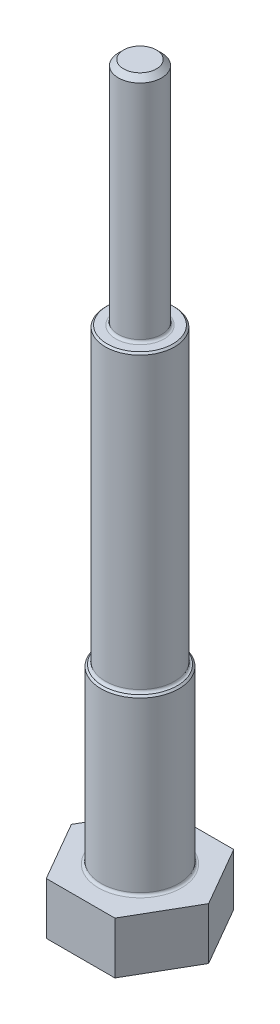
ISO-10303-21;
HEADER;
FILE_DESCRIPTION(('STEP AP214'),'2;1');
FILE_NAME('part.step','',(''),(''),'','','');
FILE_SCHEMA(('AUTOMOTIVE_DESIGN { 1 0 10303 214 1 1 1 1 }'));
ENDSEC;
DATA;
#1=APPLICATION_CONTEXT('core data for automotive mechanical design processes');
#2=APPLICATION_PROTOCOL_DEFINITION('international standard','automotive_design',2000,#1);
#3=PRODUCT_CONTEXT('',#1,'mechanical');
#4=PRODUCT('Part','Part','',(#3));
#5=PRODUCT_RELATED_PRODUCT_CATEGORY('part','',(#4));
#6=PRODUCT_DEFINITION_FORMATION('','',#4);
#7=PRODUCT_DEFINITION_CONTEXT('part definition',#1,'design');
#8=PRODUCT_DEFINITION('design','',#6,#7);
#9=PRODUCT_DEFINITION_SHAPE('','',#8);
#10=(LENGTH_UNIT() NAMED_UNIT(*) SI_UNIT(.MILLI.,.METRE.));
#11=(NAMED_UNIT(*) PLANE_ANGLE_UNIT() SI_UNIT($,.RADIAN.));
#12=(NAMED_UNIT(*) SI_UNIT($,.STERADIAN.) SOLID_ANGLE_UNIT());
#13=UNCERTAINTY_MEASURE_WITH_UNIT(LENGTH_MEASURE(1.E-05),#10,'distance_accuracy_value','');
#14=(GEOMETRIC_REPRESENTATION_CONTEXT(3) GLOBAL_UNCERTAINTY_ASSIGNED_CONTEXT((#13)) GLOBAL_UNIT_ASSIGNED_CONTEXT((#10,
#11,#12)) REPRESENTATION_CONTEXT('',''));
#15=CARTESIAN_POINT('',(0.,0.,0.));
#16=DIRECTION('',(0.,0.,1.));
#17=DIRECTION('',(1.,0.,0.));
#18=AXIS2_PLACEMENT_3D('',#15,#16,#17);
#19=CARTESIAN_POINT('',(0.,152.4,0.));
#20=DIRECTION('',(0.,1.,0.));
#21=DIRECTION('',(0.,0.,1.));
#22=AXIS2_PLACEMENT_3D('',#19,#20,#21);
#23=PLANE('',#22);
#24=CARTESIAN_POINT('',(0.,152.4,0.));
#25=DIRECTION('',(0.,1.,0.));
#26=DIRECTION('',(0.,0.,1.));
#27=AXIS2_PLACEMENT_3D('',#24,#25,#26);
#28=CIRCLE('',#27,9.65199999999999);
#29=CARTESIAN_POINT('',(0.,152.4,9.65199999999999));
#30=VERTEX_POINT('',#29);
#31=EDGE_CURVE('E185',#30,#30,#28,.T.);
#32=ORIENTED_EDGE('',*,*,#31,.T.);
#33=EDGE_LOOP('',(#32));
#34=FACE_BOUND('',#33,.T.);
#35=CARTESIAN_POINT('',(0.,152.4,0.));
#36=DIRECTION('',(0.,1.,0.));
#37=DIRECTION('',(0.,0.,1.));
#38=AXIS2_PLACEMENT_3D('',#35,#36,#37);
#39=CIRCLE('',#38,7.112);
#40=CARTESIAN_POINT('',(0.,152.4,7.112));
#41=VERTEX_POINT('',#40);
#42=EDGE_CURVE('E182',#41,#41,#39,.F.);
#43=ORIENTED_EDGE('',*,*,#42,.T.);
#44=EDGE_LOOP('',(#43));
#45=FACE_BOUND('',#44,.T.);
#46=ADVANCED_FACE('F56',(#34,#45),#23,.T.);
#47=CARTESIAN_POINT('',(10.0819790757238,15.24,17.4625));
#48=DIRECTION('',(0.,1.,0.));
#49=DIRECTION('',(0.,0.,1.));
#50=AXIS2_PLACEMENT_3D('',#47,#48,#49);
#51=PLANE('',#50);
#52=CARTESIAN_POINT('',(0.,15.24,0.));
#53=DIRECTION('',(0.,1.,0.));
#54=DIRECTION('',(0.,0.,1.));
#55=AXIS2_PLACEMENT_3D('',#52,#53,#54);
#56=CIRCLE('',#55,12.192);
#57=CARTESIAN_POINT('',(0.,15.24,12.192));
#58=VERTEX_POINT('',#57);
#59=EDGE_CURVE('E170',#58,#58,#56,.F.);
#60=ORIENTED_EDGE('',*,*,#59,.T.);
#61=EDGE_LOOP('',(#60));
#62=FACE_BOUND('',#61,.T.);
#63=DIRECTION('',(1.,0.,0.));
#64=VECTOR('',#63,1.);
#65=CARTESIAN_POINT('',(-10.0819790757238,15.24,17.4625));
#66=LINE('',#65,#64);
#67=CARTESIAN_POINT('',(-10.0819790757238,15.24,17.4625));
#68=VERTEX_POINT('',#67);
#69=CARTESIAN_POINT('',(10.0819790757238,15.24,17.4625));
#70=VERTEX_POINT('',#69);
#71=EDGE_CURVE('E152',#68,#70,#66,.T.);
#72=ORIENTED_EDGE('',*,*,#71,.T.);
#73=DIRECTION('',(0.5,0.,-0.866025403784439));
#74=VECTOR('',#73,1.);
#75=CARTESIAN_POINT('',(10.0819790757238,15.24,17.4625));
#76=LINE('',#75,#74);
#77=CARTESIAN_POINT('',(20.1639581514477,15.24,0.));
#78=VERTEX_POINT('',#77);
#79=EDGE_CURVE('E111',#70,#78,#76,.T.);
#80=ORIENTED_EDGE('',*,*,#79,.T.);
#81=DIRECTION('',(-0.5,0.,-0.866025403784439));
#82=VECTOR('',#81,1.);
#83=CARTESIAN_POINT('',(20.1639581514477,15.24,0.));
#84=LINE('',#83,#82);
#85=CARTESIAN_POINT('',(10.0819790757238,15.24,-17.4625));
#86=VERTEX_POINT('',#85);
#87=EDGE_CURVE('E124',#78,#86,#84,.T.);
#88=ORIENTED_EDGE('',*,*,#87,.T.);
#89=DIRECTION('',(-1.,0.,0.));
#90=VECTOR('',#89,1.);
#91=CARTESIAN_POINT('',(10.0819790757238,15.24,-17.4625));
#92=LINE('',#91,#90);
#93=CARTESIAN_POINT('',(-10.0819790757238,15.24,-17.4625));
#94=VERTEX_POINT('',#93);
#95=EDGE_CURVE('E118',#86,#94,#92,.T.);
#96=ORIENTED_EDGE('',*,*,#95,.T.);
#97=DIRECTION('',(-0.5,0.,0.866025403784439));
#98=VECTOR('',#97,1.);
#99=CARTESIAN_POINT('',(-10.0819790757238,15.24,-17.4625));
#100=LINE('',#99,#98);
#101=CARTESIAN_POINT('',(-20.1639581514477,15.24,0.));
#102=VERTEX_POINT('',#101);
#103=EDGE_CURVE('E122',#94,#102,#100,.T.);
#104=ORIENTED_EDGE('',*,*,#103,.T.);
#105=DIRECTION('',(0.5,0.,0.866025403784439));
#106=VECTOR('',#105,1.);
#107=CARTESIAN_POINT('',(-20.1639581514477,15.24,0.));
#108=LINE('',#107,#106);
#109=EDGE_CURVE('E73',#102,#68,#108,.T.);
#110=ORIENTED_EDGE('',*,*,#109,.T.);
#111=EDGE_LOOP('',(#72,#80,#88,#96,#104,#110));
#112=FACE_BOUND('',#111,.T.);
#113=ADVANCED_FACE('F120',(#62,#112),#51,.T.);
#114=CARTESIAN_POINT('',(-10.0819790757238,15.24,17.4625));
#115=DIRECTION('',(0.,0.,-1.));
#116=DIRECTION('',(-1.,0.,0.));
#117=AXIS2_PLACEMENT_3D('',#114,#115,#116);
#118=PLANE('',#117);
#119=DIRECTION('',(1.,0.,0.));
#120=VECTOR('',#119,1.);
#121=CARTESIAN_POINT('',(-10.0819790757238,0.,17.4625));
#122=LINE('',#121,#120);
#123=CARTESIAN_POINT('',(-10.0819790757238,0.,17.4625));
#124=VERTEX_POINT('',#123);
#125=CARTESIAN_POINT('',(10.0819790757238,0.,17.4625));
#126=VERTEX_POINT('',#125);
#127=EDGE_CURVE('E142',#124,#126,#122,.T.);
#128=ORIENTED_EDGE('',*,*,#127,.T.);
#129=DIRECTION('',(0.,-1.,0.));
#130=VECTOR('',#129,1.);
#131=CARTESIAN_POINT('',(10.0819790757238,15.24,17.4625));
#132=LINE('',#131,#130);
#133=EDGE_CURVE('E159',#70,#126,#132,.T.);
#134=ORIENTED_EDGE('',*,*,#133,.F.);
#135=ORIENTED_EDGE('',*,*,#71,.F.);
#136=DIRECTION('',(0.,-1.,0.));
#137=VECTOR('',#136,1.);
#138=CARTESIAN_POINT('',(-10.0819790757238,15.24,17.4625));
#139=LINE('',#138,#137);
#140=EDGE_CURVE('E138',#68,#124,#139,.T.);
#141=ORIENTED_EDGE('',*,*,#140,.T.);
#142=EDGE_LOOP('',(#128,#134,#135,#141));
#143=FACE_BOUND('',#142,.T.);
#144=ADVANCED_FACE('F238',(#143),#118,.F.);
#145=CARTESIAN_POINT('',(10.0819790757238,15.24,17.4625));
#146=DIRECTION('',(-0.866025403784439,0.,-0.5));
#147=DIRECTION('',(-0.5,0.,0.866025403784439));
#148=AXIS2_PLACEMENT_3D('',#145,#146,#147);
#149=PLANE('',#148);
#150=DIRECTION('',(0.5,0.,-0.866025403784439));
#151=VECTOR('',#150,1.);
#152=CARTESIAN_POINT('',(10.0819790757238,0.,17.4625));
#153=LINE('',#152,#151);
#154=CARTESIAN_POINT('',(20.1639581514477,0.,0.));
#155=VERTEX_POINT('',#154);
#156=EDGE_CURVE('E145',#126,#155,#153,.T.);
#157=ORIENTED_EDGE('',*,*,#156,.T.);
#158=DIRECTION('',(0.,-1.,0.));
#159=VECTOR('',#158,1.);
#160=CARTESIAN_POINT('',(20.1639581514477,15.24,0.));
#161=LINE('',#160,#159);
#162=EDGE_CURVE('E156',#78,#155,#161,.T.);
#163=ORIENTED_EDGE('',*,*,#162,.F.);
#164=ORIENTED_EDGE('',*,*,#79,.F.);
#165=ORIENTED_EDGE('',*,*,#133,.T.);
#166=EDGE_LOOP('',(#157,#163,#164,#165));
#167=FACE_BOUND('',#166,.T.);
#168=ADVANCED_FACE('F253',(#167),#149,.F.);
#169=CARTESIAN_POINT('',(20.1639581514477,15.24,0.));
#170=DIRECTION('',(-0.866025403784439,0.,0.5));
#171=DIRECTION('',(0.5,0.,0.866025403784439));
#172=AXIS2_PLACEMENT_3D('',#169,#170,#171);
#173=PLANE('',#172);
#174=DIRECTION('',(-0.5,0.,-0.866025403784439));
#175=VECTOR('',#174,1.);
#176=CARTESIAN_POINT('',(20.1639581514477,0.,0.));
#177=LINE('',#176,#175);
#178=CARTESIAN_POINT('',(10.0819790757238,0.,-17.4625));
#179=VERTEX_POINT('',#178);
#180=EDGE_CURVE('E147',#155,#179,#177,.T.);
#181=ORIENTED_EDGE('',*,*,#180,.T.);
#182=DIRECTION('',(0.,-1.,0.));
#183=VECTOR('',#182,1.);
#184=CARTESIAN_POINT('',(10.0819790757238,15.24,-17.4625));
#185=LINE('',#184,#183);
#186=EDGE_CURVE('E133',#86,#179,#185,.T.);
#187=ORIENTED_EDGE('',*,*,#186,.F.);
#188=ORIENTED_EDGE('',*,*,#87,.F.);
#189=ORIENTED_EDGE('',*,*,#162,.T.);
#190=EDGE_LOOP('',(#181,#187,#188,#189));
#191=FACE_BOUND('',#190,.T.);
#192=ADVANCED_FACE('F250',(#191),#173,.F.);
#193=CARTESIAN_POINT('',(10.0819790757238,15.24,-17.4625));
#194=DIRECTION('',(0.,0.,1.));
#195=DIRECTION('',(1.,0.,0.));
#196=AXIS2_PLACEMENT_3D('',#193,#194,#195);
#197=PLANE('',#196);
#198=DIRECTION('',(-1.,0.,0.));
#199=VECTOR('',#198,1.);
#200=CARTESIAN_POINT('',(10.0819790757238,0.,-17.4625));
#201=LINE('',#200,#199);
#202=CARTESIAN_POINT('',(-10.0819790757238,0.,-17.4625));
#203=VERTEX_POINT('',#202);
#204=EDGE_CURVE('E132',#179,#203,#201,.T.);
#205=ORIENTED_EDGE('',*,*,#204,.T.);
#206=DIRECTION('',(0.,-1.,0.));
#207=VECTOR('',#206,1.);
#208=CARTESIAN_POINT('',(-10.0819790757238,15.24,-17.4625));
#209=LINE('',#208,#207);
#210=EDGE_CURVE('E129',#94,#203,#209,.T.);
#211=ORIENTED_EDGE('',*,*,#210,.F.);
#212=ORIENTED_EDGE('',*,*,#95,.F.);
#213=ORIENTED_EDGE('',*,*,#186,.T.);
#214=EDGE_LOOP('',(#205,#211,#212,#213));
#215=FACE_BOUND('',#214,.T.);
#216=ADVANCED_FACE('F130',(#215),#197,.F.);
#217=CARTESIAN_POINT('',(-10.0819790757238,15.24,-17.4625));
#218=DIRECTION('',(0.866025403784439,0.,0.5));
#219=DIRECTION('',(0.5,0.,-0.866025403784439));
#220=AXIS2_PLACEMENT_3D('',#217,#218,#219);
#221=PLANE('',#220);
#222=DIRECTION('',(-0.5,0.,0.866025403784439));
#223=VECTOR('',#222,1.);
#224=CARTESIAN_POINT('',(-10.0819790757238,0.,-17.4625));
#225=LINE('',#224,#223);
#226=CARTESIAN_POINT('',(-20.1639581514477,0.,0.));
#227=VERTEX_POINT('',#226);
#228=EDGE_CURVE('E96',#203,#227,#225,.T.);
#229=ORIENTED_EDGE('',*,*,#228,.T.);
#230=DIRECTION('',(0.,-1.,0.));
#231=VECTOR('',#230,1.);
#232=CARTESIAN_POINT('',(-20.1639581514477,15.24,0.));
#233=LINE('',#232,#231);
#234=EDGE_CURVE('E134',#102,#227,#233,.T.);
#235=ORIENTED_EDGE('',*,*,#234,.F.);
#236=ORIENTED_EDGE('',*,*,#103,.F.);
#237=ORIENTED_EDGE('',*,*,#210,.T.);
#238=EDGE_LOOP('',(#229,#235,#236,#237));
#239=FACE_BOUND('',#238,.T.);
#240=ADVANCED_FACE('F136',(#239),#221,.F.);
#241=CARTESIAN_POINT('',(-20.1639581514477,15.24,0.));
#242=DIRECTION('',(0.866025403784439,0.,-0.5));
#243=DIRECTION('',(-0.5,0.,-0.866025403784439));
#244=AXIS2_PLACEMENT_3D('',#241,#242,#243);
#245=PLANE('',#244);
#246=DIRECTION('',(0.5,0.,0.866025403784439));
#247=VECTOR('',#246,1.);
#248=CARTESIAN_POINT('',(-20.1639581514477,0.,0.));
#249=LINE('',#248,#247);
#250=EDGE_CURVE('E102',#227,#124,#249,.T.);
#251=ORIENTED_EDGE('',*,*,#250,.T.);
#252=ORIENTED_EDGE('',*,*,#140,.F.);
#253=ORIENTED_EDGE('',*,*,#109,.F.);
#254=ORIENTED_EDGE('',*,*,#234,.T.);
#255=EDGE_LOOP('',(#251,#252,#253,#254));
#256=FACE_BOUND('',#255,.T.);
#257=ADVANCED_FACE('F242',(#256),#245,.F.);
#258=CARTESIAN_POINT('',(10.0819790757238,0.,17.4625));
#259=DIRECTION('',(0.,1.,0.));
#260=DIRECTION('',(0.,0.,1.));
#261=AXIS2_PLACEMENT_3D('',#258,#259,#260);
#262=PLANE('',#261);
#263=ORIENTED_EDGE('',*,*,#127,.F.);
#264=ORIENTED_EDGE('',*,*,#250,.F.);
#265=ORIENTED_EDGE('',*,*,#228,.F.);
#266=ORIENTED_EDGE('',*,*,#204,.F.);
#267=ORIENTED_EDGE('',*,*,#180,.F.);
#268=ORIENTED_EDGE('',*,*,#156,.F.);
#269=EDGE_LOOP('',(#263,#264,#265,#266,#267,#268));
#270=FACE_BOUND('',#269,.T.);
#271=ADVANCED_FACE('F234',(#270),#262,.F.);
#272=CARTESIAN_POINT('',(0.,66.04,0.));
#273=DIRECTION('',(0.,-1.,0.));
#274=DIRECTION('',(0.,0.,-1.));
#275=AXIS2_PLACEMENT_3D('',#272,#273,#274);
#276=CYLINDRICAL_SURFACE('',#275,11.43);
#277=CARTESIAN_POINT('',(0.,65.532,0.));
#278=DIRECTION('',(0.,1.,0.));
#279=DIRECTION('',(0.,0.,1.));
#280=AXIS2_PLACEMENT_3D('',#277,#278,#279);
#281=CIRCLE('',#280,11.43);
#282=CARTESIAN_POINT('',(0.,65.532,11.43));
#283=VERTEX_POINT('',#282);
#284=EDGE_CURVE('E12',#283,#283,#281,.F.);
#285=ORIENTED_EDGE('',*,*,#284,.T.);
#286=EDGE_LOOP('',(#285));
#287=FACE_BOUND('',#286,.T.);
#288=CARTESIAN_POINT('',(0.,16.002,0.));
#289=DIRECTION('',(0.,1.,0.));
#290=DIRECTION('',(0.,0.,1.));
#291=AXIS2_PLACEMENT_3D('',#288,#289,#290);
#292=CIRCLE('',#291,11.43);
#293=CARTESIAN_POINT('',(0.,16.002,11.43));
#294=VERTEX_POINT('',#293);
#295=EDGE_CURVE('E167',#294,#294,#292,.T.);
#296=ORIENTED_EDGE('',*,*,#295,.T.);
#297=EDGE_LOOP('',(#296));
#298=FACE_BOUND('',#297,.T.);
#299=ADVANCED_FACE('F231',(#287,#298),#276,.T.);
#300=CARTESIAN_POINT('',(0.,152.4,0.));
#301=DIRECTION('',(0.,-1.,0.));
#302=DIRECTION('',(0.,0.,-1.));
#303=AXIS2_PLACEMENT_3D('',#300,#301,#302);
#304=CYLINDRICAL_SURFACE('',#303,10.16);
#305=CARTESIAN_POINT('',(0.,151.892,0.));
#306=DIRECTION('',(0.,1.,0.));
#307=DIRECTION('',(0.,0.,1.));
#308=AXIS2_PLACEMENT_3D('',#305,#306,#307);
#309=CIRCLE('',#308,10.16);
#310=CARTESIAN_POINT('',(0.,151.892,10.16));
#311=VERTEX_POINT('',#310);
#312=EDGE_CURVE('E65',#311,#311,#309,.F.);
#313=ORIENTED_EDGE('',*,*,#312,.T.);
#314=EDGE_LOOP('',(#313));
#315=FACE_BOUND('',#314,.T.);
#316=CARTESIAN_POINT('',(0.,66.802,0.));
#317=DIRECTION('',(0.,1.,0.));
#318=DIRECTION('',(0.,0.,1.));
#319=AXIS2_PLACEMENT_3D('',#316,#317,#318);
#320=CIRCLE('',#319,10.16);
#321=CARTESIAN_POINT('',(0.,66.802,10.16));
#322=VERTEX_POINT('',#321);
#323=EDGE_CURVE('E173',#322,#322,#320,.T.);
#324=ORIENTED_EDGE('',*,*,#323,.T.);
#325=EDGE_LOOP('',(#324));
#326=FACE_BOUND('',#325,.T.);
#327=ADVANCED_FACE('F190',(#315,#326),#304,.T.);
#328=CARTESIAN_POINT('',(0.,219.964,0.));
#329=DIRECTION('',(0.,-1.,0.));
#330=DIRECTION('',(0.,0.,-1.));
#331=AXIS2_PLACEMENT_3D('',#328,#329,#330);
#332=CYLINDRICAL_SURFACE('',#331,6.35);
#333=CARTESIAN_POINT('',(0.,153.162,0.));
#334=DIRECTION('',(0.,1.,0.));
#335=DIRECTION('',(0.,0.,1.));
#336=AXIS2_PLACEMENT_3D('',#333,#334,#335);
#337=CIRCLE('',#336,6.35);
#338=CARTESIAN_POINT('',(0.,153.162,6.35));
#339=VERTEX_POINT('',#338);
#340=EDGE_CURVE('E179',#339,#339,#337,.T.);
#341=ORIENTED_EDGE('',*,*,#340,.T.);
#342=EDGE_LOOP('',(#341));
#343=FACE_BOUND('',#342,.T.);
#344=CARTESIAN_POINT('',(0.,218.44,0.));
#345=DIRECTION('',(0.,1.,0.));
#346=DIRECTION('',(0.,0.,1.));
#347=AXIS2_PLACEMENT_3D('',#344,#345,#346);
#348=CIRCLE('',#347,6.35);
#349=CARTESIAN_POINT('',(0.,218.44,6.35));
#350=VERTEX_POINT('',#349);
#351=EDGE_CURVE('E164',#350,#350,#348,.F.);
#352=ORIENTED_EDGE('',*,*,#351,.T.);
#353=EDGE_LOOP('',(#352));
#354=FACE_BOUND('',#353,.T.);
#355=ADVANCED_FACE('F210',(#343,#354),#332,.T.);
#356=CARTESIAN_POINT('',(0.,219.964,0.));
#357=DIRECTION('',(0.,1.,0.));
#358=DIRECTION('',(0.,0.,1.));
#359=AXIS2_PLACEMENT_3D('',#356,#357,#358);
#360=PLANE('',#359);
#361=CARTESIAN_POINT('',(0.,219.964,0.));
#362=DIRECTION('',(0.,1.,0.));
#363=DIRECTION('',(0.,0.,1.));
#364=AXIS2_PLACEMENT_3D('',#361,#362,#363);
#365=CIRCLE('',#364,4.826);
#366=CARTESIAN_POINT('',(0.,219.964,4.826));
#367=VERTEX_POINT('',#366);
#368=EDGE_CURVE('E161',#367,#367,#365,.T.);
#369=ORIENTED_EDGE('',*,*,#368,.T.);
#370=EDGE_LOOP('',(#369));
#371=FACE_BOUND('',#370,.T.);
#372=ADVANCED_FACE('F213',(#371),#360,.T.);
#373=CARTESIAN_POINT('',(0.,219.964,0.));
#374=DIRECTION('',(0.,-1.,0.));
#375=DIRECTION('',(0.,0.,-1.));
#376=AXIS2_PLACEMENT_3D('',#373,#374,#375);
#377=CONICAL_SURFACE('',#376,4.826,0.78539816339745);
#378=ORIENTED_EDGE('',*,*,#351,.F.);
#379=EDGE_LOOP('',(#378));
#380=FACE_BOUND('',#379,.T.);
#381=ORIENTED_EDGE('',*,*,#368,.F.);
#382=EDGE_LOOP('',(#381));
#383=FACE_BOUND('',#382,.T.);
#384=ADVANCED_FACE('F217',(#380,#383),#377,.T.);
#385=CARTESIAN_POINT('',(0.,16.002,0.));
#386=DIRECTION('',(0.,1.,0.));
#387=DIRECTION('',(0.,0.,1.));
#388=AXIS2_PLACEMENT_3D('',#385,#386,#387);
#389=TOROIDAL_SURFACE('',#388,12.192,0.762);
#390=ORIENTED_EDGE('',*,*,#59,.F.);
#391=EDGE_LOOP('',(#390));
#392=FACE_BOUND('',#391,.T.);
#393=ORIENTED_EDGE('',*,*,#295,.F.);
#394=EDGE_LOOP('',(#393));
#395=FACE_BOUND('',#394,.T.);
#396=ADVANCED_FACE('F220',(#392,#395),#389,.F.);
#397=CARTESIAN_POINT('',(0.,66.802,0.));
#398=DIRECTION('',(0.,1.,0.));
#399=DIRECTION('',(0.,0.,1.));
#400=AXIS2_PLACEMENT_3D('',#397,#398,#399);
#401=TOROIDAL_SURFACE('',#400,10.922,0.762);
#402=CARTESIAN_POINT('',(0.,66.04,0.));
#403=DIRECTION('',(0.,1.,0.));
#404=DIRECTION('',(0.,0.,1.));
#405=AXIS2_PLACEMENT_3D('',#402,#403,#404);
#406=CIRCLE('',#405,10.922);
#407=CARTESIAN_POINT('',(0.,66.04,10.922));
#408=VERTEX_POINT('',#407);
#409=EDGE_CURVE('E176',#408,#408,#406,.F.);
#410=ORIENTED_EDGE('',*,*,#409,.F.);
#411=EDGE_LOOP('',(#410));
#412=FACE_BOUND('',#411,.T.);
#413=ORIENTED_EDGE('',*,*,#323,.F.);
#414=EDGE_LOOP('',(#413));
#415=FACE_BOUND('',#414,.T.);
#416=ADVANCED_FACE('F206',(#412,#415),#401,.F.);
#417=CARTESIAN_POINT('',(0.,153.162,0.));
#418=DIRECTION('',(0.,1.,0.));
#419=DIRECTION('',(0.,0.,1.));
#420=AXIS2_PLACEMENT_3D('',#417,#418,#419);
#421=TOROIDAL_SURFACE('',#420,7.112,0.762);
#422=ORIENTED_EDGE('',*,*,#42,.F.);
#423=EDGE_LOOP('',(#422));
#424=FACE_BOUND('',#423,.T.);
#425=ORIENTED_EDGE('',*,*,#340,.F.);
#426=EDGE_LOOP('',(#425));
#427=FACE_BOUND('',#426,.T.);
#428=ADVANCED_FACE('F196',(#424,#427),#421,.F.);
#429=CARTESIAN_POINT('',(0.,152.4,0.));
#430=DIRECTION('',(0.,-1.,0.));
#431=DIRECTION('',(0.,0.,-1.));
#432=AXIS2_PLACEMENT_3D('',#429,#430,#431);
#433=CONICAL_SURFACE('',#432,9.65199999999999,0.785398163397447);
#434=ORIENTED_EDGE('',*,*,#312,.F.);
#435=EDGE_LOOP('',(#434));
#436=FACE_BOUND('',#435,.T.);
#437=ORIENTED_EDGE('',*,*,#31,.F.);
#438=EDGE_LOOP('',(#437));
#439=FACE_BOUND('',#438,.T.);
#440=ADVANCED_FACE('F193',(#436,#439),#433,.T.);
#441=CARTESIAN_POINT('',(0.,66.04,0.));
#442=DIRECTION('',(0.,-1.,0.));
#443=DIRECTION('',(0.,0.,-1.));
#444=AXIS2_PLACEMENT_3D('',#441,#442,#443);
#445=CONICAL_SURFACE('',#444,10.922,0.785398163397467);
#446=ORIENTED_EDGE('',*,*,#284,.F.);
#447=EDGE_LOOP('',(#446));
#448=FACE_BOUND('',#447,.T.);
#449=ORIENTED_EDGE('',*,*,#409,.T.);
#450=EDGE_LOOP('',(#449));
#451=FACE_BOUND('',#450,.T.);
#452=ADVANCED_FACE('F58',(#448,#451),#445,.T.);
#453=CLOSED_SHELL('',(#46,#113,#144,#168,#192,#216,#240,#257,#271,#299,#327,#355,#372,#384,#396,
#416,#428,#440,#452));
#454=MANIFOLD_SOLID_BREP('B2',#453);
#455=ADVANCED_BREP_SHAPE_REPRESENTATION('',(#18,#454),#14);
#456=SHAPE_DEFINITION_REPRESENTATION(#9,#455);
ENDSEC;
END-ISO-10303-21;
